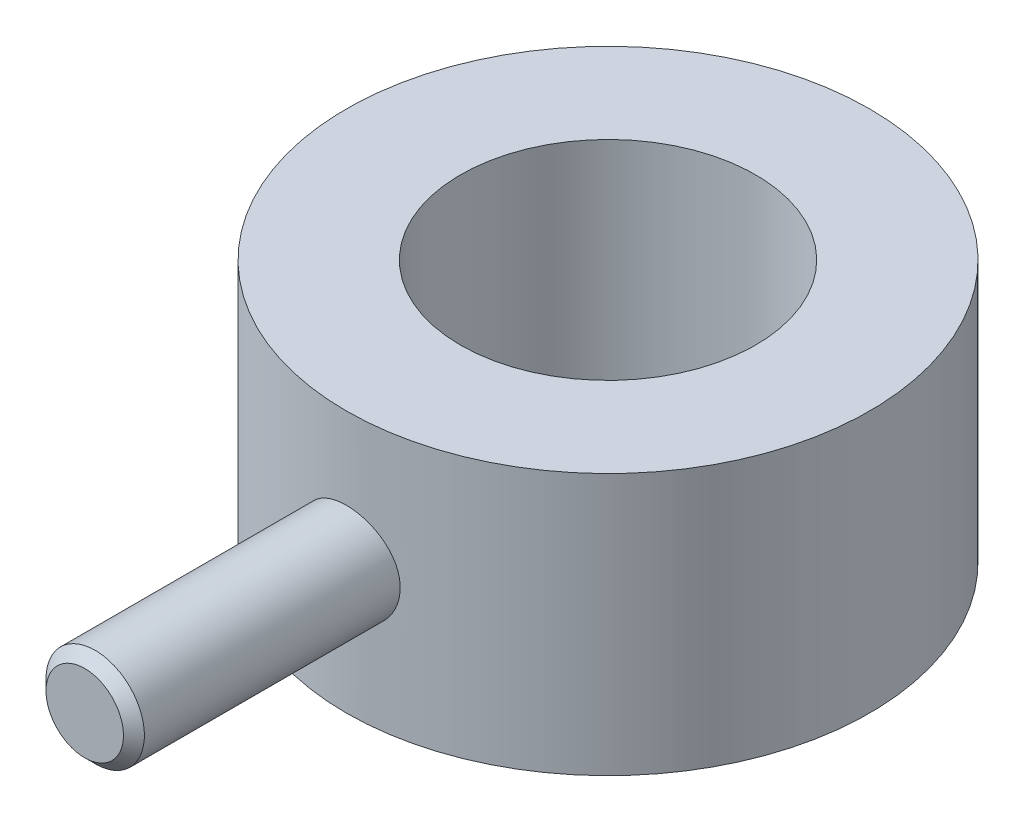
ISO-10303-21;
HEADER;
FILE_DESCRIPTION(('STEP AP214'),'2;1');
FILE_NAME('part.step','',(''),(''),'','','');
FILE_SCHEMA(('AUTOMOTIVE_DESIGN { 1 0 10303 214 1 1 1 1 }'));
ENDSEC;
DATA;
#1=APPLICATION_CONTEXT('core data for automotive mechanical design processes');
#2=APPLICATION_PROTOCOL_DEFINITION('international standard','automotive_design',2000,#1);
#3=PRODUCT_CONTEXT('',#1,'mechanical');
#4=PRODUCT('Part','Part','',(#3));
#5=PRODUCT_RELATED_PRODUCT_CATEGORY('part','',(#4));
#6=PRODUCT_DEFINITION_FORMATION('','',#4);
#7=PRODUCT_DEFINITION_CONTEXT('part definition',#1,'design');
#8=PRODUCT_DEFINITION('design','',#6,#7);
#9=PRODUCT_DEFINITION_SHAPE('','',#8);
#10=(LENGTH_UNIT() NAMED_UNIT(*) SI_UNIT(.MILLI.,.METRE.));
#11=(NAMED_UNIT(*) PLANE_ANGLE_UNIT() SI_UNIT($,.RADIAN.));
#12=(NAMED_UNIT(*) SI_UNIT($,.STERADIAN.) SOLID_ANGLE_UNIT());
#13=UNCERTAINTY_MEASURE_WITH_UNIT(LENGTH_MEASURE(1.E-05),#10,'distance_accuracy_value','');
#14=(GEOMETRIC_REPRESENTATION_CONTEXT(3) GLOBAL_UNCERTAINTY_ASSIGNED_CONTEXT((#13)) GLOBAL_UNIT_ASSIGNED_CONTEXT((#10,
#11,#12)) REPRESENTATION_CONTEXT('',''));
#15=CARTESIAN_POINT('',(0.,0.,0.));
#16=DIRECTION('',(0.,0.,1.));
#17=DIRECTION('',(1.,0.,0.));
#18=AXIS2_PLACEMENT_3D('',#15,#16,#17);
#19=CARTESIAN_POINT('',(0.,3.175,0.));
#20=DIRECTION('',(0.,-1.,0.));
#21=DIRECTION('',(0.,0.,-1.));
#22=AXIS2_PLACEMENT_3D('',#19,#20,#21);
#23=CYLINDRICAL_SURFACE('',#22,6.35000000000001);
#24=CARTESIAN_POINT('',(0.,-3.175,0.));
#25=DIRECTION('',(0.,1.,0.));
#26=DIRECTION('',(0.,0.,1.));
#27=AXIS2_PLACEMENT_3D('',#24,#25,#26);
#28=CIRCLE('',#27,6.35000000000001);
#29=CARTESIAN_POINT('',(0.,-3.175,6.35000000000001));
#30=VERTEX_POINT('',#29);
#31=EDGE_CURVE('E409',#30,#30,#28,.T.);
#32=ORIENTED_EDGE('',*,*,#31,.T.);
#33=EDGE_LOOP('',(#32));
#34=FACE_BOUND('',#33,.T.);
#35=CARTESIAN_POINT('',(0.,3.175,0.));
#36=DIRECTION('',(0.,1.,0.));
#37=DIRECTION('',(0.,0.,1.));
#38=AXIS2_PLACEMENT_3D('',#35,#36,#37);
#39=CIRCLE('',#38,6.35000000000001);
#40=CARTESIAN_POINT('',(0.,3.175,6.35000000000001));
#41=VERTEX_POINT('',#40);
#42=EDGE_CURVE('E373',#41,#41,#39,.T.);
#43=ORIENTED_EDGE('',*,*,#42,.F.);
#44=EDGE_LOOP('',(#43));
#45=FACE_BOUND('',#44,.T.);
#46=CARTESIAN_POINT('',(-1.1938,0.,6.2367733292144));
#47=CARTESIAN_POINT('',(-1.19379745581925,-0.0664173990432789,6.236774616495));
#48=CARTESIAN_POINT('',(-1.18823846801575,-0.132867768265788,6.23784580198072));
#49=CARTESIAN_POINT('',(-1.16616452441156,-0.263894527363688,6.24200942897904));
#50=CARTESIAN_POINT('',(-1.14964029509568,-0.328469282706024,6.24510358132085));
#51=CARTESIAN_POINT('',(-1.10616146236944,-0.45383001840992,6.25295060472029));
#52=CARTESIAN_POINT('',(-1.07921660061033,-0.514619475988931,6.25770192617964));
#53=CARTESIAN_POINT('',(-1.01568720308013,-0.630811365712372,6.26832609768368));
#54=CARTESIAN_POINT('',(-0.979103411155741,-0.686214213095878,6.27419886117584));
#55=CARTESIAN_POINT('',(-0.896846756191933,-0.79075744281343,6.28648627449141));
#56=CARTESIAN_POINT('',(-0.851076585972295,-0.839820646278025,6.29290626165693));
#57=CARTESIAN_POINT('',(-0.751956719808875,-0.929619372655585,6.30551761683556));
#58=CARTESIAN_POINT('',(-0.698606525365318,-0.970354347433093,6.31170896977881));
#59=CARTESIAN_POINT('',(-0.585333940718813,-1.0426361868353,6.32322264818391));
#60=CARTESIAN_POINT('',(-0.525364327257584,-1.07411026232468,6.32853795183957));
#61=CARTESIAN_POINT('',(-0.400871895564072,-1.12650788258325,6.33764089031143));
#62=CARTESIAN_POINT('',(-0.336349454184564,-1.14743229941785,6.34142865139354));
#63=CARTESIAN_POINT('',(-0.205382730208655,-1.17789791905244,6.3470120280481));
#64=CARTESIAN_POINT('',(-0.138969700762673,-1.187569235111,6.34883039722016));
#65=CARTESIAN_POINT('',(-0.00544047022970794,-1.19565955429303,6.35034854091785));
#66=CARTESIAN_POINT('',(0.0616756701829064,-1.19407952048449,6.35004849677074));
#67=CARTESIAN_POINT('',(0.193813567728612,-1.17981173621751,6.3473813961306));
#68=CARTESIAN_POINT('',(0.258851054894763,-1.16726408785871,6.34504041190579));
#69=CARTESIAN_POINT('',(0.385880654513344,-1.13163886418685,6.33858371622081));
#70=CARTESIAN_POINT('',(0.447872655450843,-1.10856090360885,6.3344679398279));
#71=CARTESIAN_POINT('',(0.567457676471901,-1.05239680551117,6.32488056139059));
#72=CARTESIAN_POINT('',(0.625023783454058,-1.01925470577018,6.31940140980225));
#73=CARTESIAN_POINT('',(0.73382985509739,-0.943944354231157,6.30769314085088));
#74=CARTESIAN_POINT('',(0.785069172268781,-0.901775179798829,6.30146394685642));
#75=CARTESIAN_POINT('',(0.880597311577492,-0.808835807285054,6.2888321515211));
#76=CARTESIAN_POINT('',(0.924766808106993,-0.757943037801927,6.28242835731868));
#77=CARTESIAN_POINT('',(1.0039615497069,-0.649409328083947,6.27026087346445));
#78=CARTESIAN_POINT('',(1.03898665955402,-0.591768288076804,6.26449719327909));
#79=CARTESIAN_POINT('',(1.09893269856702,-0.471215526068617,6.25426076575022));
#80=CARTESIAN_POINT('',(1.12383620856107,-0.408294940592753,6.24979024770448));
#81=CARTESIAN_POINT('',(1.16268458029218,-0.279059729438796,6.24268039230722));
#82=CARTESIAN_POINT('',(1.17663069090155,-0.212745491471016,6.24004084627422));
#83=CARTESIAN_POINT('',(1.19299400117164,-0.0796816217322561,6.23693309809595));
#84=CARTESIAN_POINT('',(1.19558267017649,-0.0129538083916527,6.23643260455335));
#85=CARTESIAN_POINT('',(1.18961732714017,0.119980594008554,6.23757320697655));
#86=CARTESIAN_POINT('',(1.18106386926113,0.186187208825604,6.23921419643406));
#87=CARTESIAN_POINT('',(1.15320429944139,0.31563563664976,6.2444227809438));
#88=CARTESIAN_POINT('',(1.13398814590698,0.378897517445151,6.24797425021904));
#89=CARTESIAN_POINT('',(1.08544414001921,0.501303646103134,6.25658972991075));
#90=CARTESIAN_POINT('',(1.05611553894865,0.560447588687181,6.26165385231908));
#91=CARTESIAN_POINT('',(0.987784771605896,0.673694163383349,6.27279753481525));
#92=CARTESIAN_POINT('',(0.948674325991682,0.727730349011758,6.27888819379419));
#93=CARTESIAN_POINT('',(0.86203601699738,0.828534992736788,6.29136749393374));
#94=CARTESIAN_POINT('',(0.814507392559535,0.875302793006085,6.29775616199779));
#95=CARTESIAN_POINT('',(0.711615904193267,0.960884077155959,6.3102154441422));
#96=CARTESIAN_POINT('',(0.656156340224001,0.999582216841582,6.31628063008217));
#97=CARTESIAN_POINT('',(0.539423422379744,1.06711146904904,6.32731810734023));
#98=CARTESIAN_POINT('',(0.478150293285767,1.09594296286551,6.33229044088873));
#99=CARTESIAN_POINT('',(0.351847659779798,1.14274801392603,6.34055862896701));
#100=CARTESIAN_POINT('',(0.286839707948739,1.16077812299625,6.34386320063956));
#101=CARTESIAN_POINT('',(0.154650284540892,1.18564902199597,6.3484607231973));
#102=CARTESIAN_POINT('',(0.0874690437092562,1.1924909958558,6.3497538869293));
#103=CARTESIAN_POINT('',(-0.0460539435314426,1.19475000640129,6.35017862557747));
#104=CARTESIAN_POINT('',(-0.112392701018395,1.1903412224147,6.34934315539611));
#105=CARTESIAN_POINT('',(-0.243366321652169,1.17060546859532,6.34567301308298));
#106=CARTESIAN_POINT('',(-0.308001201316086,1.15527860464089,6.34283836033834));
#107=CARTESIAN_POINT('',(-0.433639618956086,1.11421531809002,6.33548837836741));
#108=CARTESIAN_POINT('',(-0.494649434037015,1.08849752877923,6.330976058728));
#109=CARTESIAN_POINT('',(-0.611513860739696,1.027403349193,6.32075910951097));
#110=CARTESIAN_POINT('',(-0.667368124169287,0.992026307195196,6.31505439948729));
#111=CARTESIAN_POINT('',(-0.7732036328749,0.912018773773132,6.30297847847055));
#112=CARTESIAN_POINT('',(-0.823088838492997,0.867262493673946,6.29659886042944));
#113=CARTESIAN_POINT('',(-0.914701151740148,0.770027862367022,6.28394508458939));
#114=CARTESIAN_POINT('',(-0.956426337407666,0.717547697011256,6.27767095195314));
#115=CARTESIAN_POINT('',(-1.03089932979136,0.605770426016342,6.26587467495467));
#116=CARTESIAN_POINT('',(-1.06355993866271,0.546414402319426,6.26036007558724));
#117=CARTESIAN_POINT('',(-1.11839366598777,0.42297315686472,6.25079808377768));
#118=CARTESIAN_POINT('',(-1.14057666888261,0.358892458565843,6.24674930934035));
#119=CARTESIAN_POINT('',(-1.16932521601923,0.245520259985661,6.24142019504088));
#120=CARTESIAN_POINT('',(-1.17848750277441,0.196891856817479,6.23968798659899));
#121=CARTESIAN_POINT('',(-1.19072575792923,0.0988483760125295,6.23736409030699));
#122=CARTESIAN_POINT('',(-1.19380189358968,0.0494333200323359,6.23677237111374));
#123=CARTESIAN_POINT('',(-1.1938,0.,6.2367733292144));
#124=B_SPLINE_CURVE_WITH_KNOTS('',3,(#46,#47,#48,#49,#50,#51,#52,#53,#54,#55,#56,#57,#58,#59,
#60,#61,#62,#63,#64,#65,#66,#67,#68,#69,#70,#71,#72,#73,#74,#75,#76,#77,#78,#79,#80,#81,#82,#83,
#84,#85,#86,#87,#88,#89,#90,#91,#92,#93,#94,#95,#96,#97,#98,#99,#100,#101,#102,#103,#104,#105,
#106,#107,#108,#109,#110,#111,#112,#113,#114,#115,#116,#117,#118,#119,#120,#121,#122,#123),
.UNSPECIFIED.,.T.,.F.,(4,2,2,2,2,2,2,2,2,2,2,2,2,2,2,2,2,2,2,2,2,2,2,2,2,2,2,2,2,2,2,2,2,2,2,2,
2,2,4),(0.,0.199071291151422,0.398311155647987,0.597365210712737,0.796403909057293,
0.99767421544021,1.19895776448313,1.40178351603619,1.60459249867382,1.80503245127809,
2.00545524727589,2.20335462140707,2.40126123652035,2.60028912503842,2.79933736541024,
3.00145412403001,3.20357387129687,3.40604000653061,3.60848306228735,3.80785897287949,
4.00722496773803,4.20493398994932,4.40265765351673,4.60267518513847,4.80271080887605,
5.00543470176138,5.20815075953596,5.40979598292282,5.61141986679763,5.80994129702457,
6.0084608021111,6.20662588559487,6.40480434284045,6.60583355660886,6.80691006270151,
7.00985862962295,7.21261535312432,7.36078474011116,7.50895005502098),.UNSPECIFIED.);
#125=CARTESIAN_POINT('',(-1.1938,0.,6.2367733292144));
#126=VERTEX_POINT('',#125);
#127=EDGE_CURVE('E369',#126,#126,#124,.T.);
#128=ORIENTED_EDGE('',*,*,#127,.F.);
#129=EDGE_LOOP('',(#128));
#130=FACE_BOUND('',#129,.T.);
#131=ADVANCED_FACE('F358',(#34,#45,#130),#23,.T.);
#132=CARTESIAN_POINT('',(0.,3.175,0.));
#133=DIRECTION('',(0.,1.,0.));
#134=DIRECTION('',(0.,0.,1.));
#135=AXIS2_PLACEMENT_3D('',#132,#133,#134);
#136=PLANE('',#135);
#137=ORIENTED_EDGE('',*,*,#42,.T.);
#138=EDGE_LOOP('',(#137));
#139=FACE_BOUND('',#138,.T.);
#140=CARTESIAN_POINT('',(0.,3.175,0.));
#141=DIRECTION('',(0.,1.,0.));
#142=DIRECTION('',(0.,0.,1.));
#143=AXIS2_PLACEMENT_3D('',#140,#141,#142);
#144=CIRCLE('',#143,3.5814);
#145=CARTESIAN_POINT('',(0.,3.175,3.5814));
#146=VERTEX_POINT('',#145);
#147=EDGE_CURVE('E408',#146,#146,#144,.T.);
#148=ORIENTED_EDGE('',*,*,#147,.F.);
#149=EDGE_LOOP('',(#148));
#150=FACE_BOUND('',#149,.T.);
#151=ADVANCED_FACE('F395',(#139,#150),#136,.T.);
#152=CARTESIAN_POINT('',(0.,3.175,0.));
#153=DIRECTION('',(0.,-1.,0.));
#154=DIRECTION('',(0.,0.,-1.));
#155=AXIS2_PLACEMENT_3D('',#152,#153,#154);
#156=CYLINDRICAL_SURFACE('',#155,3.5814);
#157=ORIENTED_EDGE('',*,*,#147,.T.);
#158=EDGE_LOOP('',(#157));
#159=FACE_BOUND('',#158,.T.);
#160=CARTESIAN_POINT('',(0.,-3.175,0.));
#161=DIRECTION('',(0.,1.,0.));
#162=DIRECTION('',(0.,0.,1.));
#163=AXIS2_PLACEMENT_3D('',#160,#161,#162);
#164=CIRCLE('',#163,3.5814);
#165=CARTESIAN_POINT('',(0.,-3.175,3.5814));
#166=VERTEX_POINT('',#165);
#167=EDGE_CURVE('E411',#166,#166,#164,.T.);
#168=ORIENTED_EDGE('',*,*,#167,.F.);
#169=EDGE_LOOP('',(#168));
#170=FACE_BOUND('',#169,.T.);
#171=ADVANCED_FACE('F392',(#159,#170),#156,.F.);
#172=CARTESIAN_POINT('',(0.,-3.175,0.));
#173=DIRECTION('',(0.,1.,0.));
#174=DIRECTION('',(0.,0.,1.));
#175=AXIS2_PLACEMENT_3D('',#172,#173,#174);
#176=PLANE('',#175);
#177=ORIENTED_EDGE('',*,*,#167,.T.);
#178=EDGE_LOOP('',(#177));
#179=FACE_BOUND('',#178,.T.);
#180=ORIENTED_EDGE('',*,*,#31,.F.);
#181=EDGE_LOOP('',(#180));
#182=FACE_BOUND('',#181,.T.);
#183=ADVANCED_FACE('F386',(#179,#182),#176,.F.);
#184=CARTESIAN_POINT('',(0.,0.,4.7752));
#185=DIRECTION('',(0.,0.,-1.));
#186=DIRECTION('',(-1.,0.,0.));
#187=AXIS2_PLACEMENT_3D('',#184,#185,#186);
#188=CYLINDRICAL_SURFACE('',#187,1.1938);
#189=CARTESIAN_POINT('',(0.,0.,12.446));
#190=DIRECTION('',(0.,0.,-1.));
#191=DIRECTION('',(-1.,0.,0.));
#192=AXIS2_PLACEMENT_3D('',#189,#190,#191);
#193=CIRCLE('',#192,1.1938);
#194=CARTESIAN_POINT('',(-1.1938,0.,12.446));
#195=VERTEX_POINT('',#194);
#196=EDGE_CURVE('E365',#195,#195,#193,.T.);
#197=ORIENTED_EDGE('',*,*,#196,.T.);
#198=EDGE_LOOP('',(#197));
#199=FACE_BOUND('',#198,.T.);
#200=ORIENTED_EDGE('',*,*,#127,.T.);
#201=EDGE_LOOP('',(#200));
#202=FACE_BOUND('',#201,.T.);
#203=ADVANCED_FACE('F380',(#199,#202),#188,.T.);
#204=CARTESIAN_POINT('',(0.,0.,12.7));
#205=DIRECTION('',(0.,0.,-1.));
#206=DIRECTION('',(-1.,0.,0.));
#207=AXIS2_PLACEMENT_3D('',#204,#205,#206);
#208=PLANE('',#207);
#209=CARTESIAN_POINT('',(0.,0.,12.7));
#210=DIRECTION('',(0.,0.,-1.));
#211=DIRECTION('',(-1.,0.,0.));
#212=AXIS2_PLACEMENT_3D('',#209,#210,#211);
#213=CIRCLE('',#212,0.9398);
#214=CARTESIAN_POINT('',(-0.9398,0.,12.7));
#215=VERTEX_POINT('',#214);
#216=EDGE_CURVE('E10',#215,#215,#213,.F.);
#217=ORIENTED_EDGE('',*,*,#216,.T.);
#218=EDGE_LOOP('',(#217));
#219=FACE_BOUND('',#218,.T.);
#220=ADVANCED_FACE('F385',(#219),#208,.F.);
#221=CARTESIAN_POINT('',(0.,0.,12.446));
#222=DIRECTION('',(0.,0.,-1.));
#223=DIRECTION('',(-1.,0.,0.));
#224=AXIS2_PLACEMENT_3D('',#221,#222,#223);
#225=CONICAL_SURFACE('',#224,1.1938,0.785398163397447);
#226=ORIENTED_EDGE('',*,*,#216,.F.);
#227=EDGE_LOOP('',(#226));
#228=FACE_BOUND('',#227,.T.);
#229=ORIENTED_EDGE('',*,*,#196,.F.);
#230=EDGE_LOOP('',(#229));
#231=FACE_BOUND('',#230,.T.);
#232=ADVANCED_FACE('F387',(#228,#231),#225,.T.);
#233=CLOSED_SHELL('',(#131,#151,#171,#183,#203,#220,#232));
#234=MANIFOLD_SOLID_BREP('B2',#233);
#235=ADVANCED_BREP_SHAPE_REPRESENTATION('',(#18,#234),#14);
#236=SHAPE_DEFINITION_REPRESENTATION(#9,#235);
ENDSEC;
END-ISO-10303-21;
